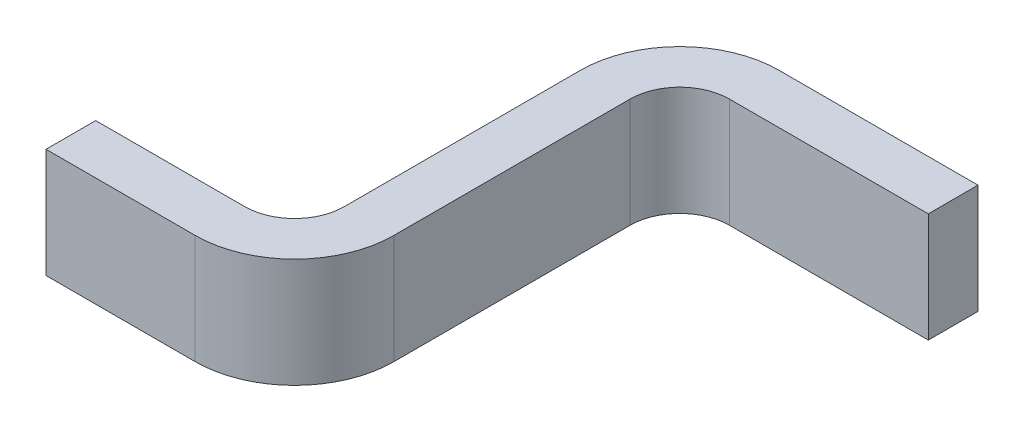
ISO-10303-21;
HEADER;
FILE_DESCRIPTION(('STEP AP214'),'2;1');
FILE_NAME('part.step','',(''),(''),'','','');
FILE_SCHEMA(('AUTOMOTIVE_DESIGN { 1 0 10303 214 1 1 1 1 }'));
ENDSEC;
DATA;
#1=APPLICATION_CONTEXT('core data for automotive mechanical design processes');
#2=APPLICATION_PROTOCOL_DEFINITION('international standard','automotive_design',2000,#1);
#3=PRODUCT_CONTEXT('',#1,'mechanical');
#4=PRODUCT('Part','Part','',(#3));
#5=PRODUCT_RELATED_PRODUCT_CATEGORY('part','',(#4));
#6=PRODUCT_DEFINITION_FORMATION('','',#4);
#7=PRODUCT_DEFINITION_CONTEXT('part definition',#1,'design');
#8=PRODUCT_DEFINITION('design','',#6,#7);
#9=PRODUCT_DEFINITION_SHAPE('','',#8);
#10=(LENGTH_UNIT() NAMED_UNIT(*) SI_UNIT(.MILLI.,.METRE.));
#11=(NAMED_UNIT(*) PLANE_ANGLE_UNIT() SI_UNIT($,.RADIAN.));
#12=(NAMED_UNIT(*) SI_UNIT($,.STERADIAN.) SOLID_ANGLE_UNIT());
#13=UNCERTAINTY_MEASURE_WITH_UNIT(LENGTH_MEASURE(1.E-05),#10,'distance_accuracy_value','');
#14=(GEOMETRIC_REPRESENTATION_CONTEXT(3) GLOBAL_UNCERTAINTY_ASSIGNED_CONTEXT((#13)) GLOBAL_UNIT_ASSIGNED_CONTEXT((#10,
#11,#12)) REPRESENTATION_CONTEXT('',''));
#15=CARTESIAN_POINT('',(0.,0.,0.));
#16=DIRECTION('',(0.,0.,1.));
#17=DIRECTION('',(1.,0.,0.));
#18=AXIS2_PLACEMENT_3D('',#15,#16,#17);
#19=CARTESIAN_POINT('',(3.90000000000001,0.860000000000001,0.675));
#20=DIRECTION('',(0.,-1.,0.));
#21=DIRECTION('',(0.,0.,-1.));
#22=AXIS2_PLACEMENT_3D('',#19,#20,#21);
#23=PLANE('',#22);
#24=CARTESIAN_POINT('',(3.8,0.860000000000001,0.675));
#25=DIRECTION('',(0.,-1.,0.));
#26=DIRECTION('',(0.,0.,-1.));
#27=AXIS2_PLACEMENT_3D('',#24,#25,#26);
#28=CIRCLE('',#27,0.1);
#29=CARTESIAN_POINT('',(3.90000000000001,0.860000000000001,0.675));
#30=VERTEX_POINT('',#29);
#31=CARTESIAN_POINT('',(3.8,0.860000000000001,0.775));
#32=VERTEX_POINT('',#31);
#33=EDGE_CURVE('E162',#30,#32,#28,.T.);
#34=ORIENTED_EDGE('',*,*,#33,.T.);
#35=DIRECTION('',(1.,0.,0.));
#36=VECTOR('',#35,1.);
#37=CARTESIAN_POINT('',(3.50000000000001,0.86,0.775));
#38=LINE('',#37,#36);
#39=CARTESIAN_POINT('',(3.50000000000001,0.86,0.775));
#40=VERTEX_POINT('',#39);
#41=EDGE_CURVE('E120',#32,#40,#38,.F.);
#42=ORIENTED_EDGE('',*,*,#41,.T.);
#43=DIRECTION('',(0.,0.,1.));
#44=VECTOR('',#43,1.);
#45=CARTESIAN_POINT('',(3.50000000000001,0.86,0.775));
#46=LINE('',#45,#44);
#47=CARTESIAN_POINT('',(3.50000000000001,0.86,0.875));
#48=VERTEX_POINT('',#47);
#49=EDGE_CURVE('E116',#48,#40,#46,.F.);
#50=ORIENTED_EDGE('',*,*,#49,.F.);
#51=DIRECTION('',(-1.,0.,0.));
#52=VECTOR('',#51,1.);
#53=CARTESIAN_POINT('',(3.50000000000001,0.86,0.875));
#54=LINE('',#53,#52);
#55=CARTESIAN_POINT('',(3.8,0.860000000000001,0.875));
#56=VERTEX_POINT('',#55);
#57=EDGE_CURVE('E111',#48,#56,#54,.F.);
#58=ORIENTED_EDGE('',*,*,#57,.T.);
#59=CARTESIAN_POINT('',(3.8,0.860000000000001,0.675));
#60=DIRECTION('',(0.,-1.,0.));
#61=DIRECTION('',(0.,0.,-1.));
#62=AXIS2_PLACEMENT_3D('',#59,#60,#61);
#63=CIRCLE('',#62,0.2);
#64=CARTESIAN_POINT('',(4.,0.86,0.675));
#65=VERTEX_POINT('',#64);
#66=EDGE_CURVE('E102',#65,#56,#63,.T.);
#67=ORIENTED_EDGE('',*,*,#66,.F.);
#68=DIRECTION('',(0.,0.,1.));
#69=VECTOR('',#68,1.);
#70=CARTESIAN_POINT('',(4.,0.86,0.675));
#71=LINE('',#70,#69);
#72=CARTESIAN_POINT('',(4.,0.86,0.2));
#73=VERTEX_POINT('',#72);
#74=EDGE_CURVE('E98',#65,#73,#71,.F.);
#75=ORIENTED_EDGE('',*,*,#74,.T.);
#76=CARTESIAN_POINT('',(4.1,0.86,0.2));
#77=DIRECTION('',(0.,1.,0.));
#78=DIRECTION('',(0.,0.,1.));
#79=AXIS2_PLACEMENT_3D('',#76,#77,#78);
#80=CIRCLE('',#79,0.1);
#81=CARTESIAN_POINT('',(4.1,0.86,0.1));
#82=VERTEX_POINT('',#81);
#83=EDGE_CURVE('E20',#73,#82,#80,.F.);
#84=ORIENTED_EDGE('',*,*,#83,.T.);
#85=DIRECTION('',(-1.,0.,0.));
#86=VECTOR('',#85,1.);
#87=CARTESIAN_POINT('',(4.1,0.86,0.1));
#88=LINE('',#87,#86);
#89=CARTESIAN_POINT('',(4.5,0.86,0.1));
#90=VERTEX_POINT('',#89);
#91=EDGE_CURVE('E145',#82,#90,#88,.F.);
#92=ORIENTED_EDGE('',*,*,#91,.T.);
#93=DIRECTION('',(0.,0.,1.));
#94=VECTOR('',#93,1.);
#95=CARTESIAN_POINT('',(4.5,0.86,0.));
#96=LINE('',#95,#94);
#97=CARTESIAN_POINT('',(4.5,0.86,0.));
#98=VERTEX_POINT('',#97);
#99=EDGE_CURVE('E139',#90,#98,#96,.F.);
#100=ORIENTED_EDGE('',*,*,#99,.T.);
#101=DIRECTION('',(1.,0.,0.));
#102=VECTOR('',#101,1.);
#103=CARTESIAN_POINT('',(4.1,0.86,0.));
#104=LINE('',#103,#102);
#105=CARTESIAN_POINT('',(4.1,0.86,0.));
#106=VERTEX_POINT('',#105);
#107=EDGE_CURVE('E132',#98,#106,#104,.F.);
#108=ORIENTED_EDGE('',*,*,#107,.T.);
#109=CARTESIAN_POINT('',(4.1,0.86,0.2));
#110=DIRECTION('',(0.,1.,0.));
#111=DIRECTION('',(0.,0.,1.));
#112=AXIS2_PLACEMENT_3D('',#109,#110,#111);
#113=CIRCLE('',#112,0.2);
#114=CARTESIAN_POINT('',(3.90000000000001,0.860000000000001,0.2));
#115=VERTEX_POINT('',#114);
#116=EDGE_CURVE('E135',#115,#106,#113,.F.);
#117=ORIENTED_EDGE('',*,*,#116,.F.);
#118=DIRECTION('',(0.,0.,-1.));
#119=VECTOR('',#118,1.);
#120=CARTESIAN_POINT('',(3.90000000000001,0.860000000000001,0.675));
#121=LINE('',#120,#119);
#122=EDGE_CURVE('E128',#115,#30,#121,.F.);
#123=ORIENTED_EDGE('',*,*,#122,.T.);
#124=EDGE_LOOP('',(#34,#42,#50,#58,#67,#75,#84,#92,#100,#108,#117,#123));
#125=FACE_BOUND('',#124,.T.);
#126=ADVANCED_FACE('F17',(#125),#23,.F.);
#127=CARTESIAN_POINT('',(4.1,0.86,0.2));
#128=DIRECTION('',(0.,1.,0.));
#129=DIRECTION('',(0.,0.,1.));
#130=AXIS2_PLACEMENT_3D('',#127,#128,#129);
#131=CYLINDRICAL_SURFACE('',#130,0.1);
#132=DIRECTION('',(0.,1.,0.));
#133=VECTOR('',#132,1.);
#134=CARTESIAN_POINT('',(4.,0.86,0.2));
#135=LINE('',#134,#133);
#136=CARTESIAN_POINT('',(4.,0.64,0.2));
#137=VERTEX_POINT('',#136);
#138=EDGE_CURVE('E91',#73,#137,#135,.F.);
#139=ORIENTED_EDGE('',*,*,#138,.T.);
#140=CARTESIAN_POINT('',(4.1,0.64,0.2));
#141=DIRECTION('',(0.,1.,0.));
#142=DIRECTION('',(0.,0.,1.));
#143=AXIS2_PLACEMENT_3D('',#140,#141,#142);
#144=CIRCLE('',#143,0.1);
#145=CARTESIAN_POINT('',(4.1,0.64,0.1));
#146=VERTEX_POINT('',#145);
#147=EDGE_CURVE('E103',#137,#146,#144,.F.);
#148=ORIENTED_EDGE('',*,*,#147,.T.);
#149=DIRECTION('',(0.,1.,0.));
#150=VECTOR('',#149,1.);
#151=CARTESIAN_POINT('',(4.1,0.86,0.1));
#152=LINE('',#151,#150);
#153=EDGE_CURVE('E92',#146,#82,#152,.T.);
#154=ORIENTED_EDGE('',*,*,#153,.T.);
#155=ORIENTED_EDGE('',*,*,#83,.F.);
#156=EDGE_LOOP('',(#139,#148,#154,#155));
#157=FACE_BOUND('',#156,.T.);
#158=ADVANCED_FACE('F89',(#157),#131,.F.);
#159=CARTESIAN_POINT('',(4.1,0.86,0.1));
#160=DIRECTION('',(0.,0.,-1.));
#161=DIRECTION('',(-1.,0.,0.));
#162=AXIS2_PLACEMENT_3D('',#159,#160,#161);
#163=PLANE('',#162);
#164=ORIENTED_EDGE('',*,*,#153,.F.);
#165=DIRECTION('',(1.,0.,0.));
#166=VECTOR('',#165,1.);
#167=CARTESIAN_POINT('',(4.,0.64,0.1));
#168=LINE('',#167,#166);
#169=CARTESIAN_POINT('',(4.5,0.64,0.1));
#170=VERTEX_POINT('',#169);
#171=EDGE_CURVE('E105',#146,#170,#168,.T.);
#172=ORIENTED_EDGE('',*,*,#171,.T.);
#173=DIRECTION('',(0.,1.,0.));
#174=VECTOR('',#173,1.);
#175=CARTESIAN_POINT('',(4.5,0.64,0.1));
#176=LINE('',#175,#174);
#177=EDGE_CURVE('E142',#170,#90,#176,.T.);
#178=ORIENTED_EDGE('',*,*,#177,.T.);
#179=ORIENTED_EDGE('',*,*,#91,.F.);
#180=EDGE_LOOP('',(#164,#172,#178,#179));
#181=FACE_BOUND('',#180,.T.);
#182=ADVANCED_FACE('F187',(#181),#163,.F.);
#183=CARTESIAN_POINT('',(4.5,0.64,0.));
#184=DIRECTION('',(-1.,0.,0.));
#185=DIRECTION('',(0.,0.,1.));
#186=AXIS2_PLACEMENT_3D('',#183,#184,#185);
#187=PLANE('',#186);
#188=ORIENTED_EDGE('',*,*,#177,.F.);
#189=DIRECTION('',(0.,0.,1.));
#190=VECTOR('',#189,1.);
#191=CARTESIAN_POINT('',(4.5,0.64,0.675));
#192=LINE('',#191,#190);
#193=CARTESIAN_POINT('',(4.5,0.64,0.));
#194=VERTEX_POINT('',#193);
#195=EDGE_CURVE('E176',#170,#194,#192,.F.);
#196=ORIENTED_EDGE('',*,*,#195,.T.);
#197=DIRECTION('',(0.,1.,0.));
#198=VECTOR('',#197,1.);
#199=CARTESIAN_POINT('',(4.5,0.64,0.));
#200=LINE('',#199,#198);
#201=EDGE_CURVE('E136',#194,#98,#200,.T.);
#202=ORIENTED_EDGE('',*,*,#201,.T.);
#203=ORIENTED_EDGE('',*,*,#99,.F.);
#204=EDGE_LOOP('',(#188,#196,#202,#203));
#205=FACE_BOUND('',#204,.T.);
#206=ADVANCED_FACE('F192',(#205),#187,.F.);
#207=CARTESIAN_POINT('',(4.1,0.64,0.));
#208=DIRECTION('',(0.,0.,1.));
#209=DIRECTION('',(1.,0.,0.));
#210=AXIS2_PLACEMENT_3D('',#207,#208,#209);
#211=PLANE('',#210);
#212=DIRECTION('',(0.,1.,0.));
#213=VECTOR('',#212,1.);
#214=CARTESIAN_POINT('',(4.1,0.64,0.));
#215=LINE('',#214,#213);
#216=CARTESIAN_POINT('',(4.1,0.64,0.));
#217=VERTEX_POINT('',#216);
#218=EDGE_CURVE('E163',#106,#217,#215,.F.);
#219=ORIENTED_EDGE('',*,*,#218,.F.);
#220=ORIENTED_EDGE('',*,*,#107,.F.);
#221=ORIENTED_EDGE('',*,*,#201,.F.);
#222=DIRECTION('',(1.,0.,0.));
#223=VECTOR('',#222,1.);
#224=CARTESIAN_POINT('',(4.,0.64,0.));
#225=LINE('',#224,#223);
#226=EDGE_CURVE('E159',#194,#217,#225,.F.);
#227=ORIENTED_EDGE('',*,*,#226,.T.);
#228=EDGE_LOOP('',(#219,#220,#221,#227));
#229=FACE_BOUND('',#228,.T.);
#230=ADVANCED_FACE('F264',(#229),#211,.F.);
#231=CARTESIAN_POINT('',(4.1,0.64,0.2));
#232=DIRECTION('',(0.,1.,0.));
#233=DIRECTION('',(0.,0.,1.));
#234=AXIS2_PLACEMENT_3D('',#231,#232,#233);
#235=CYLINDRICAL_SURFACE('',#234,0.2);
#236=ORIENTED_EDGE('',*,*,#116,.T.);
#237=ORIENTED_EDGE('',*,*,#218,.T.);
#238=CARTESIAN_POINT('',(4.1,0.64,0.2));
#239=DIRECTION('',(0.,1.,0.));
#240=DIRECTION('',(0.,0.,1.));
#241=AXIS2_PLACEMENT_3D('',#238,#239,#240);
#242=CIRCLE('',#241,0.2);
#243=CARTESIAN_POINT('',(3.90000000000001,0.640000000000001,0.2));
#244=VERTEX_POINT('',#243);
#245=EDGE_CURVE('E157',#217,#244,#242,.T.);
#246=ORIENTED_EDGE('',*,*,#245,.T.);
#247=DIRECTION('',(0.,1.,0.));
#248=VECTOR('',#247,1.);
#249=CARTESIAN_POINT('',(3.90000000000001,0.640000000000001,0.2));
#250=LINE('',#249,#248);
#251=EDGE_CURVE('E131',#244,#115,#250,.T.);
#252=ORIENTED_EDGE('',*,*,#251,.T.);
#253=EDGE_LOOP('',(#236,#237,#246,#252));
#254=FACE_BOUND('',#253,.T.);
#255=ADVANCED_FACE('F266',(#254),#235,.T.);
#256=CARTESIAN_POINT('',(3.90000000000001,0.640000000000001,0.675));
#257=DIRECTION('',(1.,0.,0.));
#258=DIRECTION('',(0.,0.,-1.));
#259=AXIS2_PLACEMENT_3D('',#256,#257,#258);
#260=PLANE('',#259);
#261=DIRECTION('',(0.,-1.,0.));
#262=VECTOR('',#261,1.);
#263=CARTESIAN_POINT('',(3.90000000000001,0.640000000000001,0.675));
#264=LINE('',#263,#262);
#265=CARTESIAN_POINT('',(3.90000000000001,0.640000000000001,0.675));
#266=VERTEX_POINT('',#265);
#267=EDGE_CURVE('E130',#266,#30,#264,.F.);
#268=ORIENTED_EDGE('',*,*,#267,.T.);
#269=ORIENTED_EDGE('',*,*,#122,.F.);
#270=ORIENTED_EDGE('',*,*,#251,.F.);
#271=DIRECTION('',(0.,0.,1.));
#272=VECTOR('',#271,1.);
#273=CARTESIAN_POINT('',(3.90000000000001,0.640000000000001,0.675));
#274=LINE('',#273,#272);
#275=EDGE_CURVE('E156',#244,#266,#274,.T.);
#276=ORIENTED_EDGE('',*,*,#275,.T.);
#277=EDGE_LOOP('',(#268,#269,#270,#276));
#278=FACE_BOUND('',#277,.T.);
#279=ADVANCED_FACE('F231',(#278),#260,.F.);
#280=CARTESIAN_POINT('',(3.8,0.640000000000001,0.675));
#281=DIRECTION('',(0.,-1.,0.));
#282=DIRECTION('',(0.,0.,-1.));
#283=AXIS2_PLACEMENT_3D('',#280,#281,#282);
#284=CYLINDRICAL_SURFACE('',#283,0.1);
#285=DIRECTION('',(0.,1.,0.));
#286=VECTOR('',#285,1.);
#287=CARTESIAN_POINT('',(3.8,0.640000000000001,0.775));
#288=LINE('',#287,#286);
#289=CARTESIAN_POINT('',(3.8,0.640000000000001,0.775));
#290=VERTEX_POINT('',#289);
#291=EDGE_CURVE('E125',#290,#32,#288,.T.);
#292=ORIENTED_EDGE('',*,*,#291,.T.);
#293=ORIENTED_EDGE('',*,*,#33,.F.);
#294=ORIENTED_EDGE('',*,*,#267,.F.);
#295=CARTESIAN_POINT('',(3.8,0.640000000000001,0.675));
#296=DIRECTION('',(0.,-1.,0.));
#297=DIRECTION('',(0.,0.,-1.));
#298=AXIS2_PLACEMENT_3D('',#295,#296,#297);
#299=CIRCLE('',#298,0.1);
#300=EDGE_CURVE('E152',#266,#290,#299,.T.);
#301=ORIENTED_EDGE('',*,*,#300,.T.);
#302=EDGE_LOOP('',(#292,#293,#294,#301));
#303=FACE_BOUND('',#302,.T.);
#304=ADVANCED_FACE('F235',(#303),#284,.F.);
#305=CARTESIAN_POINT('',(3.50000000000001,0.64,0.775));
#306=DIRECTION('',(0.,0.,1.));
#307=DIRECTION('',(1.,0.,0.));
#308=AXIS2_PLACEMENT_3D('',#305,#306,#307);
#309=PLANE('',#308);
#310=DIRECTION('',(0.,1.,0.));
#311=VECTOR('',#310,1.);
#312=CARTESIAN_POINT('',(3.50000000000001,0.64,0.775));
#313=LINE('',#312,#311);
#314=CARTESIAN_POINT('',(3.50000000000001,0.64,0.775));
#315=VERTEX_POINT('',#314);
#316=EDGE_CURVE('E119',#40,#315,#313,.F.);
#317=ORIENTED_EDGE('',*,*,#316,.F.);
#318=ORIENTED_EDGE('',*,*,#41,.F.);
#319=ORIENTED_EDGE('',*,*,#291,.F.);
#320=DIRECTION('',(1.,0.,0.));
#321=VECTOR('',#320,1.);
#322=CARTESIAN_POINT('',(4.,0.64,0.775));
#323=LINE('',#322,#321);
#324=EDGE_CURVE('E155',#290,#315,#323,.F.);
#325=ORIENTED_EDGE('',*,*,#324,.T.);
#326=EDGE_LOOP('',(#317,#318,#319,#325));
#327=FACE_BOUND('',#326,.T.);
#328=ADVANCED_FACE('F259',(#327),#309,.F.);
#329=CARTESIAN_POINT('',(3.50000000000001,0.64,0.775));
#330=DIRECTION('',(-1.,0.,0.));
#331=DIRECTION('',(0.,0.,1.));
#332=AXIS2_PLACEMENT_3D('',#329,#330,#331);
#333=PLANE('',#332);
#334=DIRECTION('',(0.,0.,1.));
#335=VECTOR('',#334,1.);
#336=CARTESIAN_POINT('',(3.50000000000001,0.64,0.675));
#337=LINE('',#336,#335);
#338=CARTESIAN_POINT('',(3.50000000000001,0.64,0.875));
#339=VERTEX_POINT('',#338);
#340=EDGE_CURVE('E217',#315,#339,#337,.T.);
#341=ORIENTED_EDGE('',*,*,#340,.T.);
#342=DIRECTION('',(0.,1.,0.));
#343=VECTOR('',#342,1.);
#344=CARTESIAN_POINT('',(3.50000000000001,0.86,0.875));
#345=LINE('',#344,#343);
#346=EDGE_CURVE('E113',#339,#48,#345,.T.);
#347=ORIENTED_EDGE('',*,*,#346,.T.);
#348=ORIENTED_EDGE('',*,*,#49,.T.);
#349=ORIENTED_EDGE('',*,*,#316,.T.);
#350=EDGE_LOOP('',(#341,#347,#348,#349));
#351=FACE_BOUND('',#350,.T.);
#352=ADVANCED_FACE('F255',(#351),#333,.T.);
#353=CARTESIAN_POINT('',(3.50000000000001,0.86,0.875));
#354=DIRECTION('',(0.,0.,-1.));
#355=DIRECTION('',(-1.,0.,0.));
#356=AXIS2_PLACEMENT_3D('',#353,#354,#355);
#357=PLANE('',#356);
#358=ORIENTED_EDGE('',*,*,#346,.F.);
#359=DIRECTION('',(1.,0.,0.));
#360=VECTOR('',#359,1.);
#361=CARTESIAN_POINT('',(4.,0.64,0.875));
#362=LINE('',#361,#360);
#363=CARTESIAN_POINT('',(3.8,0.640000000000001,0.875));
#364=VERTEX_POINT('',#363);
#365=EDGE_CURVE('E151',#339,#364,#362,.T.);
#366=ORIENTED_EDGE('',*,*,#365,.T.);
#367=DIRECTION('',(0.,-1.,0.));
#368=VECTOR('',#367,1.);
#369=CARTESIAN_POINT('',(3.8,0.860000000000001,0.875));
#370=LINE('',#369,#368);
#371=EDGE_CURVE('E99',#56,#364,#370,.T.);
#372=ORIENTED_EDGE('',*,*,#371,.F.);
#373=ORIENTED_EDGE('',*,*,#57,.F.);
#374=EDGE_LOOP('',(#358,#366,#372,#373));
#375=FACE_BOUND('',#374,.T.);
#376=ADVANCED_FACE('F251',(#375),#357,.F.);
#377=CARTESIAN_POINT('',(3.8,0.860000000000001,0.675));
#378=DIRECTION('',(0.,-1.,0.));
#379=DIRECTION('',(0.,0.,-1.));
#380=AXIS2_PLACEMENT_3D('',#377,#378,#379);
#381=CYLINDRICAL_SURFACE('',#380,0.2);
#382=CARTESIAN_POINT('',(3.8,0.640000000000001,0.675));
#383=DIRECTION('',(0.,-1.,0.));
#384=DIRECTION('',(0.,0.,-1.));
#385=AXIS2_PLACEMENT_3D('',#382,#383,#384);
#386=CIRCLE('',#385,0.2);
#387=CARTESIAN_POINT('',(4.,0.64,0.675));
#388=VERTEX_POINT('',#387);
#389=EDGE_CURVE('E26',#364,#388,#386,.F.);
#390=ORIENTED_EDGE('',*,*,#389,.T.);
#391=DIRECTION('',(0.,1.,0.));
#392=VECTOR('',#391,1.);
#393=CARTESIAN_POINT('',(4.,0.86,0.675));
#394=LINE('',#393,#392);
#395=EDGE_CURVE('E34',#388,#65,#394,.T.);
#396=ORIENTED_EDGE('',*,*,#395,.T.);
#397=ORIENTED_EDGE('',*,*,#66,.T.);
#398=ORIENTED_EDGE('',*,*,#371,.T.);
#399=EDGE_LOOP('',(#390,#396,#397,#398));
#400=FACE_BOUND('',#399,.T.);
#401=ADVANCED_FACE('F280',(#400),#381,.T.);
#402=CARTESIAN_POINT('',(4.,0.86,0.675));
#403=DIRECTION('',(-1.,0.,0.));
#404=DIRECTION('',(0.,0.,1.));
#405=AXIS2_PLACEMENT_3D('',#402,#403,#404);
#406=PLANE('',#405);
#407=ORIENTED_EDGE('',*,*,#395,.F.);
#408=DIRECTION('',(0.,0.,1.));
#409=VECTOR('',#408,1.);
#410=CARTESIAN_POINT('',(4.,0.64,0.675));
#411=LINE('',#410,#409);
#412=EDGE_CURVE('E11',#388,#137,#411,.F.);
#413=ORIENTED_EDGE('',*,*,#412,.T.);
#414=ORIENTED_EDGE('',*,*,#138,.F.);
#415=ORIENTED_EDGE('',*,*,#74,.F.);
#416=EDGE_LOOP('',(#407,#413,#414,#415));
#417=FACE_BOUND('',#416,.T.);
#418=ADVANCED_FACE('F97',(#417),#406,.F.);
#419=CARTESIAN_POINT('',(4.,0.64,0.675));
#420=DIRECTION('',(0.,1.,0.));
#421=DIRECTION('',(0.,0.,1.));
#422=AXIS2_PLACEMENT_3D('',#419,#420,#421);
#423=PLANE('',#422);
#424=ORIENTED_EDGE('',*,*,#389,.F.);
#425=ORIENTED_EDGE('',*,*,#365,.F.);
#426=ORIENTED_EDGE('',*,*,#340,.F.);
#427=ORIENTED_EDGE('',*,*,#324,.F.);
#428=ORIENTED_EDGE('',*,*,#300,.F.);
#429=ORIENTED_EDGE('',*,*,#275,.F.);
#430=ORIENTED_EDGE('',*,*,#245,.F.);
#431=ORIENTED_EDGE('',*,*,#226,.F.);
#432=ORIENTED_EDGE('',*,*,#195,.F.);
#433=ORIENTED_EDGE('',*,*,#171,.F.);
#434=ORIENTED_EDGE('',*,*,#147,.F.);
#435=ORIENTED_EDGE('',*,*,#412,.F.);
#436=EDGE_LOOP('',(#424,#425,#426,#427,#428,#429,#430,#431,#432,#433,#434,#435));
#437=FACE_BOUND('',#436,.T.);
#438=ADVANCED_FACE('F197',(#437),#423,.F.);
#439=CLOSED_SHELL('',(#126,#158,#182,#206,#230,#255,#279,#304,#328,#352,#376,#401,#418,#438));
#440=MANIFOLD_SOLID_BREP('B1',#439);
#441=ADVANCED_BREP_SHAPE_REPRESENTATION('',(#18,#440),#14);
#442=SHAPE_DEFINITION_REPRESENTATION(#9,#441);
ENDSEC;
END-ISO-10303-21;
